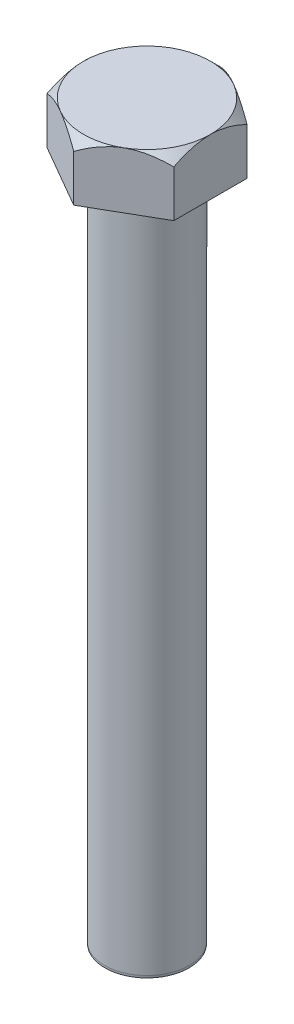
ISO-10303-21;
HEADER;
FILE_DESCRIPTION(('STEP AP214'),'2;1');
FILE_NAME('part.step','',(''),(''),'','','');
FILE_SCHEMA(('AUTOMOTIVE_DESIGN { 1 0 10303 214 1 1 1 1 }'));
ENDSEC;
DATA;
#1=APPLICATION_CONTEXT('core data for automotive mechanical design processes');
#2=APPLICATION_PROTOCOL_DEFINITION('international standard','automotive_design',2000,#1);
#3=PRODUCT_CONTEXT('',#1,'mechanical');
#4=PRODUCT('Part','Part','',(#3));
#5=PRODUCT_RELATED_PRODUCT_CATEGORY('part','',(#4));
#6=PRODUCT_DEFINITION_FORMATION('','',#4);
#7=PRODUCT_DEFINITION_CONTEXT('part definition',#1,'design');
#8=PRODUCT_DEFINITION('design','',#6,#7);
#9=PRODUCT_DEFINITION_SHAPE('','',#8);
#10=(LENGTH_UNIT() NAMED_UNIT(*) SI_UNIT(.MILLI.,.METRE.));
#11=(NAMED_UNIT(*) PLANE_ANGLE_UNIT() SI_UNIT($,.RADIAN.));
#12=(NAMED_UNIT(*) SI_UNIT($,.STERADIAN.) SOLID_ANGLE_UNIT());
#13=UNCERTAINTY_MEASURE_WITH_UNIT(LENGTH_MEASURE(1.E-05),#10,'distance_accuracy_value','');
#14=(GEOMETRIC_REPRESENTATION_CONTEXT(3) GLOBAL_UNCERTAINTY_ASSIGNED_CONTEXT((#13)) GLOBAL_UNIT_ASSIGNED_CONTEXT((#10,
#11,#12)) REPRESENTATION_CONTEXT('',''));
#15=CARTESIAN_POINT('',(0.,0.,0.));
#16=DIRECTION('',(0.,0.,1.));
#17=DIRECTION('',(1.,0.,0.));
#18=AXIS2_PLACEMENT_3D('',#15,#16,#17);
#19=CARTESIAN_POINT('',(7.15009999999996,6.35,-4.12811215973283));
#20=DIRECTION('',(-0.499999999999995,0.,0.866025403784441));
#21=DIRECTION('',(0.866025403784442,0.,0.499999999999995));
#22=AXIS2_PLACEMENT_3D('',#19,#20,#21);
#23=PLANE('',#22);
#24=CARTESIAN_POINT('',(7.15029999999996,5.24376020805829,-4.12799668967899));
#25=CARTESIAN_POINT('',(7.02735981479973,5.31473208114426,-4.19897623869856));
#26=CARTESIAN_POINT('',(6.90347465758507,5.38352591509957,-4.27050136756504));
#27=CARTESIAN_POINT('',(6.65362901516201,5.51609496244518,-4.41474981647385));
#28=CARTESIAN_POINT('',(6.52766744128796,5.57986743492815,-4.48747376505758));
#29=CARTESIAN_POINT('',(6.14521985336649,5.76320280111308,-4.70827998289497));
#30=CARTESIAN_POINT('',(5.88549626774101,5.87400155292641,-4.85823146497073));
#31=CARTESIAN_POINT('',(5.36174291484116,6.06373669034418,-5.16062060425642));
#32=CARTESIAN_POINT('',(5.09784700922402,6.14315107326227,-5.31298097640252));
#33=CARTESIAN_POINT('',(4.69766469893423,6.23501393674774,-5.54402634097325));
#34=CARTESIAN_POINT('',(4.56368142899528,6.26107948825729,-5.62138161793941));
#35=CARTESIAN_POINT('',(4.29458046497126,6.30353452510466,-5.77674713195786));
#36=CARTESIAN_POINT('',(4.15946294347778,6.319925456437,-5.85475726936435));
#37=CARTESIAN_POINT('',(3.83019852397778,6.34740730224126,-6.04485817059725));
#38=CARTESIAN_POINT('',(3.63569685436158,6.35317340265754,-6.15715376190799));
#39=CARTESIAN_POINT('',(3.24704409240871,6.34349459202812,-6.38154253864277));
#40=CARTESIAN_POINT('',(3.05289314684432,6.32804224579773,-6.49363563932778));
#41=CARTESIAN_POINT('',(2.66642169813378,6.27683739902505,-6.71676503427492));
#42=CARTESIAN_POINT('',(2.47410348685935,6.24106219749936,-6.82780000532428));
#43=CARTESIAN_POINT('',(2.09277255135678,6.15115660179108,-7.04796152358701));
#44=CARTESIAN_POINT('',(1.90375957482909,6.09702761510223,-7.15708821646561));
#45=CARTESIAN_POINT('',(1.56823093998172,5.98566881448239,-7.35080576411556));
#46=CARTESIAN_POINT('',(1.42097225552798,5.93136793728872,-7.43582560522543));
#47=CARTESIAN_POINT('',(1.12909829468736,5.81401595028394,-7.6043391150862));
#48=CARTESIAN_POINT('',(0.984483098549458,5.75096457532957,-7.68783273750533));
#49=CARTESIAN_POINT('',(0.6983516080155,5.61752492778284,-7.85303083058874));
#50=CARTESIAN_POINT('',(0.55682717595113,5.54715972840591,-7.93473999953801));
#51=CARTESIAN_POINT('',(0.276398890261677,5.40001620595466,-8.0966453457692));
#52=CARTESIAN_POINT('',(0.137493492810105,5.32324181558632,-8.17684241437976));
#53=CARTESIAN_POINT('',(-0.000199999999999894,5.24376020805829,-8.25633978951933));
#54=B_SPLINE_CURVE_WITH_KNOTS('',3,(#24,#25,#26,#27,#28,#29,#30,#31,#32,#33,#34,#35,#36,#37,#38,
#39,#40,#41,#42,#43,#44,#45,#46,#47,#48,#49,#50,#51,#52,#53),.UNSPECIFIED.,.F.,.F.,(4,2,2,2,2,2,
2,2,2,2,2,2,2,2,4),(0.,0.476107132166216,0.952472371030046,1.91034566100054,2.85300915505907,
3.32341643946382,3.7937533977268,4.46670173744884,5.13988594609707,5.81382359601269,
6.48770957546597,7.02295690652281,7.55822045931063,8.09184389327706,8.6251422671035),.UNSPECIFIED.);
#55=CARTESIAN_POINT('',(7.15009999999996,5.24387568053451,-4.12811215973283));
#56=VERTEX_POINT('',#55);
#57=CARTESIAN_POINT('',(3.57504999999996,6.35,-6.19216823959914));
#58=VERTEX_POINT('',#57);
#59=EDGE_CURVE('E106',#56,#58,#54,.T.);
#60=ORIENTED_EDGE('',*,*,#59,.F.);
#61=DIRECTION('',(0.,-1.,0.));
#62=VECTOR('',#61,1.);
#63=CARTESIAN_POINT('',(7.15009999999996,6.35,-4.12811215973283));
#64=LINE('',#63,#62);
#65=CARTESIAN_POINT('',(7.15009999999996,0.,-4.12811215973283));
#66=VERTEX_POINT('',#65);
#67=EDGE_CURVE('E267',#56,#66,#64,.T.);
#68=ORIENTED_EDGE('',*,*,#67,.T.);
#69=DIRECTION('',(-0.866025403784441,0.,-0.499999999999995));
#70=VECTOR('',#69,1.);
#71=CARTESIAN_POINT('',(7.15009999999996,0.,-4.12811215973283));
#72=LINE('',#71,#70);
#73=CARTESIAN_POINT('',(0.,0.,-8.25622431946549));
#74=VERTEX_POINT('',#73);
#75=EDGE_CURVE('E115',#66,#74,#72,.T.);
#76=ORIENTED_EDGE('',*,*,#75,.T.);
#77=DIRECTION('',(0.,-1.,0.));
#78=VECTOR('',#77,1.);
#79=CARTESIAN_POINT('',(0.,6.35,-8.25622431946549));
#80=LINE('',#79,#78);
#81=CARTESIAN_POINT('',(0.,5.24387568053451,-8.25622431946549));
#82=VERTEX_POINT('',#81);
#83=EDGE_CURVE('E133',#82,#74,#80,.T.);
#84=ORIENTED_EDGE('',*,*,#83,.F.);
#85=EDGE_CURVE('E116',#58,#82,#54,.T.);
#86=ORIENTED_EDGE('',*,*,#85,.F.);
#87=EDGE_LOOP('',(#60,#68,#76,#84,#86));
#88=FACE_BOUND('',#87,.T.);
#89=ADVANCED_FACE('F36',(#88),#23,.F.);
#90=CARTESIAN_POINT('',(0.,6.35,-8.25622431946549));
#91=DIRECTION('',(0.500000000000001,0.,0.866025403784438));
#92=DIRECTION('',(0.866025403784438,0.,-0.500000000000001));
#93=AXIS2_PLACEMENT_3D('',#90,#91,#92);
#94=PLANE('',#93);
#95=CARTESIAN_POINT('',(0.0002,5.24376020805829,-8.25633978951933));
#96=CARTESIAN_POINT('',(-0.122740185200222,5.31473208114426,-8.18536024049976));
#97=CARTESIAN_POINT('',(-0.246625342414885,5.38352591509958,-8.11383511163327));
#98=CARTESIAN_POINT('',(-0.496470984837945,5.51609496244519,-7.96958666272447));
#99=CARTESIAN_POINT('',(-0.622432558711996,5.57986743492816,-7.89686271414073));
#100=CARTESIAN_POINT('',(-1.00488014663348,5.76320280111309,-7.67605649630334));
#101=CARTESIAN_POINT('',(-1.26460373225895,5.87400155292642,-7.52610501422758));
#102=CARTESIAN_POINT('',(-1.78835708515881,6.06373669034419,-7.22371587494188));
#103=CARTESIAN_POINT('',(-2.05225299077595,6.1431510732623,-7.07135550279578));
#104=CARTESIAN_POINT('',(-2.45243530106574,6.23501393674777,-6.84031013822504));
#105=CARTESIAN_POINT('',(-2.58641857100469,6.26107948825732,-6.76295486125888));
#106=CARTESIAN_POINT('',(-2.85551953502872,6.30353452510469,-6.60758934724042));
#107=CARTESIAN_POINT('',(-2.99063705652219,6.31992545643702,-6.52957920983393));
#108=CARTESIAN_POINT('',(-3.3199014760222,6.34740730224129,-6.33947830860103));
#109=CARTESIAN_POINT('',(-3.51440314563839,6.35317340265757,-6.22718271729029));
#110=CARTESIAN_POINT('',(-3.90305590759126,6.34349459202815,-6.00279394055551));
#111=CARTESIAN_POINT('',(-4.09720685315564,6.32804224579776,-5.89070083987049));
#112=CARTESIAN_POINT('',(-4.48367830186619,6.27683739902508,-5.66757144492336));
#113=CARTESIAN_POINT('',(-4.67599651314062,6.24106219749939,-5.556536473874));
#114=CARTESIAN_POINT('',(-5.05732744864318,6.15115660179112,-5.33637495561126));
#115=CARTESIAN_POINT('',(-5.24634042517087,6.09702761510226,-5.22724826273266));
#116=CARTESIAN_POINT('',(-5.58186906001824,5.98566881448243,-5.03353071508271));
#117=CARTESIAN_POINT('',(-5.72912774447198,5.93136793728875,-4.94851087397283));
#118=CARTESIAN_POINT('',(-6.02100170531261,5.81401595028396,-4.77999736411205));
#119=CARTESIAN_POINT('',(-6.16561690145052,5.7509645753296,-4.69650374169292));
#120=CARTESIAN_POINT('',(-6.45174839198449,5.61752492778286,-4.5313056486095));
#121=CARTESIAN_POINT('',(-6.59327282404887,5.54715972840593,-4.44959647966022));
#122=CARTESIAN_POINT('',(-6.87370110973833,5.40001620595466,-4.28769113342903));
#123=CARTESIAN_POINT('',(-7.0126065071899,5.32324181558632,-4.20749406481847));
#124=CARTESIAN_POINT('',(-7.15030000000001,5.24376020805829,-4.12799668967889));
#125=B_SPLINE_CURVE_WITH_KNOTS('',3,(#95,#96,#97,#98,#99,#100,#101,#102,#103,#104,#105,#106,
#107,#108,#109,#110,#111,#112,#113,#114,#115,#116,#117,#118,#119,#120,#121,#122,#123,#124),
.UNSPECIFIED.,.F.,.F.,(4,2,2,2,2,2,2,2,2,2,2,2,2,2,4),(0.,0.476107132166221,0.952472371030056,
1.91034566100056,2.85300915505911,3.32341643946385,3.79375339772684,4.46670173744889,
5.13988594609711,5.81382359601273,6.48770957546601,7.02295690652286,7.55822045931071,
8.09184389327715,8.62514226710361),.UNSPECIFIED.);
#126=CARTESIAN_POINT('',(-3.57505000000001,6.35,-6.19216823959911));
#127=VERTEX_POINT('',#126);
#128=EDGE_CURVE('E123',#82,#127,#125,.T.);
#129=ORIENTED_EDGE('',*,*,#128,.F.);
#130=ORIENTED_EDGE('',*,*,#83,.T.);
#131=DIRECTION('',(-0.866025403784438,0.,0.500000000000001));
#132=VECTOR('',#131,1.);
#133=CARTESIAN_POINT('',(0.,0.,-8.25622431946549));
#134=LINE('',#133,#132);
#135=CARTESIAN_POINT('',(-7.15010000000001,0.,-4.12811215973273));
#136=VERTEX_POINT('',#135);
#137=EDGE_CURVE('E258',#74,#136,#134,.T.);
#138=ORIENTED_EDGE('',*,*,#137,.T.);
#139=DIRECTION('',(0.,-1.,0.));
#140=VECTOR('',#139,1.);
#141=CARTESIAN_POINT('',(-7.15010000000001,6.35,-4.12811215973273));
#142=LINE('',#141,#140);
#143=CARTESIAN_POINT('',(-7.15010000000001,5.24387568053451,-4.12811215973273));
#144=VERTEX_POINT('',#143);
#145=EDGE_CURVE('E200',#144,#136,#142,.T.);
#146=ORIENTED_EDGE('',*,*,#145,.F.);
#147=EDGE_CURVE('E134',#127,#144,#125,.T.);
#148=ORIENTED_EDGE('',*,*,#147,.F.);
#149=EDGE_LOOP('',(#129,#130,#138,#146,#148));
#150=FACE_BOUND('',#149,.T.);
#151=ADVANCED_FACE('F188',(#150),#94,.F.);
#152=CARTESIAN_POINT('',(-7.15010000000001,6.35,-4.12811215973273));
#153=DIRECTION('',(1.,0.,0.));
#154=DIRECTION('',(0.,0.,-1.));
#155=AXIS2_PLACEMENT_3D('',#152,#153,#154);
#156=PLANE('',#155);
#157=CARTESIAN_POINT('',(-7.15010000000003,1.63089085788719,-9.47386909605649));
#158=CARTESIAN_POINT('',(-7.15010000000003,1.81121581560539,-9.24790249070521));
#159=CARTESIAN_POINT('',(-7.15010000000003,1.99016418725543,-9.02082114931031));
#160=CARTESIAN_POINT('',(-7.15010000000003,2.34465316669975,-8.56394073706759));
#161=CARTESIAN_POINT('',(-7.15010000000003,2.5201930563962,-8.33414110959574));
#162=CARTESIAN_POINT('',(-7.15010000000003,2.868446395647,-7.86968034981608));
#163=CARTESIAN_POINT('',(-7.15010000000003,3.0411284373893,-7.63499559658916));
#164=CARTESIAN_POINT('',(-7.15010000000002,3.38131039804522,-7.16191403046406));
#165=CARTESIAN_POINT('',(-7.15010000000002,3.54881066036877,-6.92351746513816));
#166=CARTESIAN_POINT('',(-7.15010000000002,3.89019859321875,-6.42356671095031));
#167=CARTESIAN_POINT('',(-7.15010000000002,4.06356649358224,-6.16165586234294));
#168=CARTESIAN_POINT('',(-7.15010000000002,4.40077381694092,-5.63166319550724));
#169=CARTESIAN_POINT('',(-7.15010000000002,4.56461143837196,-5.36358022380933));
#170=CARTESIAN_POINT('',(-7.15010000000002,4.87937516438839,-4.82096243326766));
#171=CARTESIAN_POINT('',(-7.15010000000002,5.03033869234989,-4.54644949317194));
#172=CARTESIAN_POINT('',(-7.15010000000001,5.31597281014485,-3.98913965325442));
#173=CARTESIAN_POINT('',(-7.15010000000001,5.45065169434768,-3.70634706251455));
#174=CARTESIAN_POINT('',(-7.15010000000001,5.68224395499392,-3.16946720873966));
#175=CARTESIAN_POINT('',(-7.15010000000001,5.78179628197522,-2.91652981738955));
#176=CARTESIAN_POINT('',(-7.15010000000001,5.96068130805078,-2.40346766112692));
#177=CARTESIAN_POINT('',(-7.15010000000001,6.04001286165642,-2.14334248995796));
#178=CARTESIAN_POINT('',(-7.1501,6.17245096820923,-1.62248495464225));
#179=CARTESIAN_POINT('',(-7.1501,6.22609680418521,-1.36189223637387));
#180=CARTESIAN_POINT('',(-7.1501,6.30590762943054,-0.836507861915944));
#181=CARTESIAN_POINT('',(-7.1501,6.33208104018206,-0.571717517759924));
#182=CARTESIAN_POINT('',(-7.1501,6.35408284405149,-0.0577187353176461));
#183=CARTESIAN_POINT('',(-7.1501,6.35173239837544,0.19141159314656));
#184=CARTESIAN_POINT('',(-7.1501,6.32124800606946,0.688077635906895));
#185=CARTESIAN_POINT('',(-7.1501,6.29311214694111,0.935613230550542));
#186=CARTESIAN_POINT('',(-7.15009999999999,6.21229082442829,1.43154670462864));
#187=CARTESIAN_POINT('',(-7.15009999999999,6.15913527095504,1.6798664946589));
#188=CARTESIAN_POINT('',(-7.15009999999999,6.03147971556139,2.17085918647798));
#189=CARTESIAN_POINT('',(-7.15009999999999,5.9569795257941,2.4135320385497));
#190=CARTESIAN_POINT('',(-7.15009999999999,5.79048248965085,2.89215321636684));
#191=CARTESIAN_POINT('',(-7.15009999999999,5.69852189244993,3.12811432942166));
#192=CARTESIAN_POINT('',(-7.15009999999999,5.50032506783947,3.59401612680425));
#193=CARTESIAN_POINT('',(-7.15009999999999,5.39408271156479,3.8239541754974));
#194=CARTESIAN_POINT('',(-7.15009999999998,5.16984050461004,4.27885242834733));
#195=CARTESIAN_POINT('',(-7.15009999999998,5.05180562125056,4.50379521875785));
#196=CARTESIAN_POINT('',(-7.15009999999998,4.80656023664318,4.94854616944678));
#197=CARTESIAN_POINT('',(-7.15009999999998,4.67935108776111,5.168355080205));
#198=CARTESIAN_POINT('',(-7.15009999999998,4.42401096856745,5.59273981639913));
#199=CARTESIAN_POINT('',(-7.15009999999998,4.29623669089792,5.79753139755686));
#200=CARTESIAN_POINT('',(-7.15009999999998,4.03519862932643,6.20359582585859));
#201=CARTESIAN_POINT('',(-7.15009999999998,3.90193444245225,6.4048684131501));
#202=CARTESIAN_POINT('',(-7.15009999999998,3.63195773249821,6.80275896707806));
#203=CARTESIAN_POINT('',(-7.15009999999998,3.49528075722348,6.9994011408559));
#204=CARTESIAN_POINT('',(-7.15009999999997,3.21822330604325,7.38998078224734));
#205=CARTESIAN_POINT('',(-7.15009999999997,3.0778438588743,7.58391897874123));
#206=CARTESIAN_POINT('',(-7.15009999999997,2.93594735354651,7.77672110388246));
#207=B_SPLINE_CURVE_WITH_KNOTS('',3,(#157,#158,#159,#160,#161,#162,#163,#164,#165,#166,#167,
#168,#169,#170,#171,#172,#173,#174,#175,#176,#177,#178,#179,#180,#181,#182,#183,#184,#185,#186,
#187,#188,#189,#190,#191,#192,#193,#194,#195,#196,#197,#198,#199,#200,#201,#202,#203,#204,#205,
#206),.UNSPECIFIED.,.F.,.F.,(4,2,2,2,2,2,2,2,2,2,2,2,2,2,2,2,2,2,2,2,2,2,2,2,4),(0.,
0.867309176171177,1.73479913643537,2.60884845848508,3.48283973039317,4.42495432930787,
5.36724644671029,6.30669878036595,7.24567058249782,8.06046150623437,8.87529857688988,
9.67218308312768,10.4688232385201,11.214882925787,11.9609979526155,12.7217281313764,
13.4824650052708,14.2416394652586,15.0011407631884,15.7629695239043,16.524686213128,
17.248733545678,17.9728341200296,18.6912157430264,19.4093998229271),.UNSPECIFIED.);
#208=CARTESIAN_POINT('',(-7.1501,6.35,0.));
#209=VERTEX_POINT('',#208);
#210=EDGE_CURVE('E182',#144,#209,#207,.T.);
#211=ORIENTED_EDGE('',*,*,#210,.F.);
#212=ORIENTED_EDGE('',*,*,#145,.T.);
#213=DIRECTION('',(0.,0.,1.));
#214=VECTOR('',#213,1.);
#215=CARTESIAN_POINT('',(-7.15010000000001,0.,-4.12811215973273));
#216=LINE('',#215,#214);
#217=CARTESIAN_POINT('',(-7.15009999999999,0.,4.12811215973278));
#218=VERTEX_POINT('',#217);
#219=EDGE_CURVE('E217',#136,#218,#216,.T.);
#220=ORIENTED_EDGE('',*,*,#219,.T.);
#221=DIRECTION('',(0.,-1.,0.));
#222=VECTOR('',#221,1.);
#223=CARTESIAN_POINT('',(-7.15009999999999,6.35,4.12811215973278));
#224=LINE('',#223,#222);
#225=CARTESIAN_POINT('',(-7.15009999999999,5.24387568053451,4.12811215973278));
#226=VERTEX_POINT('',#225);
#227=EDGE_CURVE('E215',#226,#218,#224,.T.);
#228=ORIENTED_EDGE('',*,*,#227,.F.);
#229=EDGE_CURVE('E177',#209,#226,#207,.T.);
#230=ORIENTED_EDGE('',*,*,#229,.F.);
#231=EDGE_LOOP('',(#211,#212,#220,#228,#230));
#232=FACE_BOUND('',#231,.T.);
#233=ADVANCED_FACE('F184',(#232),#156,.F.);
#234=CARTESIAN_POINT('',(-7.15009999999999,6.35,4.12811215973278));
#235=DIRECTION('',(0.499999999999995,0.,-0.866025403784441));
#236=DIRECTION('',(-0.866025403784441,0.,-0.499999999999995));
#237=AXIS2_PLACEMENT_3D('',#234,#235,#236);
#238=PLANE('',#237);
#239=CARTESIAN_POINT('',(-7.15029999999998,5.24376020805829,4.12799668967894));
#240=CARTESIAN_POINT('',(-7.02735981479976,5.31473208114426,4.19897623869851));
#241=CARTESIAN_POINT('',(-6.9034746575851,5.38352591509958,4.27050136756499));
#242=CARTESIAN_POINT('',(-6.65362901516204,5.51609496244519,4.4147498164738));
#243=CARTESIAN_POINT('',(-6.52766744128798,5.57986743492816,4.48747376505753));
#244=CARTESIAN_POINT('',(-6.1452198533665,5.76320280111309,4.70827998289492));
#245=CARTESIAN_POINT('',(-5.88549626774103,5.87400155292642,4.85823146497068));
#246=CARTESIAN_POINT('',(-5.36174291484117,6.06373669034419,5.16062060425638));
#247=CARTESIAN_POINT('',(-5.09784700922402,6.1431510732623,5.31298097640248));
#248=CARTESIAN_POINT('',(-4.69766469893423,6.23501393674777,5.54402634097321));
#249=CARTESIAN_POINT('',(-4.56368142899528,6.26107948825732,5.62138161793937));
#250=CARTESIAN_POINT('',(-4.29458046497126,6.30353452510469,5.77674713195783));
#251=CARTESIAN_POINT('',(-4.15946294347778,6.31992545643702,5.85475726936432));
#252=CARTESIAN_POINT('',(-3.83019852397777,6.34740730224129,6.04485817059721));
#253=CARTESIAN_POINT('',(-3.63569685436158,6.35317340265757,6.15715376190795));
#254=CARTESIAN_POINT('',(-3.24704409240871,6.34349459202815,6.38154253864273));
#255=CARTESIAN_POINT('',(-3.05289314684433,6.32804224579776,6.49363563932775));
#256=CARTESIAN_POINT('',(-2.66642169813378,6.27683739902508,6.71676503427488));
#257=CARTESIAN_POINT('',(-2.47410348685935,6.24106219749939,6.82780000532424));
#258=CARTESIAN_POINT('',(-2.09277255135678,6.15115660179112,7.04796152358698));
#259=CARTESIAN_POINT('',(-1.90375957482909,6.09702761510226,7.15708821646557));
#260=CARTESIAN_POINT('',(-1.56823093998172,5.98566881448243,7.35080576411552));
#261=CARTESIAN_POINT('',(-1.42097225552798,5.93136793728875,7.4358256052254));
#262=CARTESIAN_POINT('',(-1.12909829468735,5.81401595028396,7.60433911508618));
#263=CARTESIAN_POINT('',(-0.984483098549436,5.7509645753296,7.68783273750531));
#264=CARTESIAN_POINT('',(-0.698351608015466,5.61752492778286,7.85303083058873));
#265=CARTESIAN_POINT('',(-0.556827175951092,5.54715972840593,7.934739999538));
#266=CARTESIAN_POINT('',(-0.276398890261629,5.40001620595466,8.0966453457692));
#267=CARTESIAN_POINT('',(-0.137493492810052,5.32324181558632,8.17684241437975));
#268=CARTESIAN_POINT('',(0.000200000000057124,5.24376020805829,8.25633978951933));
#269=B_SPLINE_CURVE_WITH_KNOTS('',3,(#239,#240,#241,#242,#243,#244,#245,#246,#247,#248,#249,
#250,#251,#252,#253,#254,#255,#256,#257,#258,#259,#260,#261,#262,#263,#264,#265,#266,#267,#268),
.UNSPECIFIED.,.F.,.F.,(4,2,2,2,2,2,2,2,2,2,2,2,2,2,4),(0.,0.476107132166221,0.952472371030058,
1.91034566100057,2.85300915505911,3.32341643946385,3.79375339772684,4.46670173744888,
5.13988594609711,5.81382359601273,6.48770957546601,7.02295690652286,7.55822045931071,
8.09184389327715,8.62514226710361),.UNSPECIFIED.);
#270=CARTESIAN_POINT('',(-3.57504999999996,6.35,6.19216823959913));
#271=VERTEX_POINT('',#270);
#272=EDGE_CURVE('E183',#226,#271,#269,.T.);
#273=ORIENTED_EDGE('',*,*,#272,.F.);
#274=ORIENTED_EDGE('',*,*,#227,.T.);
#275=DIRECTION('',(0.866025403784441,0.,0.499999999999995));
#276=VECTOR('',#275,1.);
#277=CARTESIAN_POINT('',(-7.15009999999999,0.,4.12811215973278));
#278=LINE('',#277,#276);
#279=CARTESIAN_POINT('',(0.,0.,8.25622431946549));
#280=VERTEX_POINT('',#279);
#281=EDGE_CURVE('E259',#218,#280,#278,.T.);
#282=ORIENTED_EDGE('',*,*,#281,.T.);
#283=DIRECTION('',(0.,-1.,0.));
#284=VECTOR('',#283,1.);
#285=CARTESIAN_POINT('',(0.,6.35,8.25622431946549));
#286=LINE('',#285,#284);
#287=CARTESIAN_POINT('',(0.,5.24387568053451,8.25622431946549));
#288=VERTEX_POINT('',#287);
#289=EDGE_CURVE('E221',#288,#280,#286,.T.);
#290=ORIENTED_EDGE('',*,*,#289,.F.);
#291=EDGE_CURVE('E172',#271,#288,#269,.T.);
#292=ORIENTED_EDGE('',*,*,#291,.F.);
#293=EDGE_LOOP('',(#273,#274,#282,#290,#292));
#294=FACE_BOUND('',#293,.T.);
#295=ADVANCED_FACE('F187',(#294),#238,.F.);
#296=CARTESIAN_POINT('',(0.,6.35,8.25622431946549));
#297=DIRECTION('',(-0.500000000000007,0.,-0.866025403784435));
#298=DIRECTION('',(-0.866025403784435,0.,0.500000000000007));
#299=AXIS2_PLACEMENT_3D('',#296,#297,#298);
#300=PLANE('',#299);
#301=CARTESIAN_POINT('',(-0.000199999999942347,5.24376020805829,8.25633978951933));
#302=CARTESIAN_POINT('',(0.122740185200279,5.31473208114426,8.18536024049976));
#303=CARTESIAN_POINT('',(0.246625342414941,5.38352591509958,8.11383511163327));
#304=CARTESIAN_POINT('',(0.496470984838001,5.51609496244519,7.96958666272446));
#305=CARTESIAN_POINT('',(0.622432558712051,5.57986743492816,7.89686271414073));
#306=CARTESIAN_POINT('',(1.00488014663353,5.76320280111309,7.67605649630334));
#307=CARTESIAN_POINT('',(1.264603732259,5.87400155292642,7.52610501422757));
#308=CARTESIAN_POINT('',(1.78835708515886,6.06373669034419,7.22371587494186));
#309=CARTESIAN_POINT('',(2.052252990776,6.1431510732623,7.07135550279576));
#310=CARTESIAN_POINT('',(2.45243530106579,6.23501393674777,6.84031013822502));
#311=CARTESIAN_POINT('',(2.58641857100474,6.26107948825731,6.76295486125886));
#312=CARTESIAN_POINT('',(2.85551953502876,6.30353452510469,6.6075893472404));
#313=CARTESIAN_POINT('',(2.99063705652223,6.31992545643702,6.52957920983391));
#314=CARTESIAN_POINT('',(3.31990147602224,6.34740730224129,6.33947830860101));
#315=CARTESIAN_POINT('',(3.51440314563843,6.35317340265757,6.22718271729027));
#316=CARTESIAN_POINT('',(3.9030559075913,6.34349459202815,6.00279394055549));
#317=CARTESIAN_POINT('',(4.09720685315568,6.32804224579776,5.89070083987047));
#318=CARTESIAN_POINT('',(4.48367830186623,6.27683739902508,5.66757144492333));
#319=CARTESIAN_POINT('',(4.67599651314065,6.24106219749939,5.55653647387397));
#320=CARTESIAN_POINT('',(5.05732744864322,6.15115660179112,5.33637495561122));
#321=CARTESIAN_POINT('',(5.24634042517091,6.09702761510226,5.22724826273263));
#322=CARTESIAN_POINT('',(5.58186906001828,5.98566881448243,5.03353071508267));
#323=CARTESIAN_POINT('',(5.72912774447202,5.93136793728875,4.94851087397279));
#324=CARTESIAN_POINT('',(6.02100170531265,5.81401595028396,4.77999736411201));
#325=CARTESIAN_POINT('',(6.16561690145056,5.7509645753296,4.69650374169287));
#326=CARTESIAN_POINT('',(6.45174839198452,5.61752492778285,4.53130564860946));
#327=CARTESIAN_POINT('',(6.5932728240489,5.54715972840592,4.44959647966018));
#328=CARTESIAN_POINT('',(6.87370110973836,5.40001620595466,4.28769113342898));
#329=CARTESIAN_POINT('',(7.01260650718993,5.32324181558632,4.20749406481842));
#330=CARTESIAN_POINT('',(7.15030000000004,5.24376020805829,4.12799668967884));
#331=B_SPLINE_CURVE_WITH_KNOTS('',3,(#301,#302,#303,#304,#305,#306,#307,#308,#309,#310,#311,
#312,#313,#314,#315,#316,#317,#318,#319,#320,#321,#322,#323,#324,#325,#326,#327,#328,#329,#330),
.UNSPECIFIED.,.F.,.F.,(4,2,2,2,2,2,2,2,2,2,2,2,2,2,4),(0.,0.476107132166222,0.952472371030056,
1.91034566100056,2.8530091550591,3.32341643946385,3.79375339772684,4.46670173744888,
5.13988594609711,5.81382359601273,6.48770957546601,7.02295690652286,7.55822045931071,
8.09184389327715,8.62514226710361),.UNSPECIFIED.);
#332=CARTESIAN_POINT('',(3.57505000000005,6.35,6.19216823959909));
#333=VERTEX_POINT('',#332);
#334=EDGE_CURVE('E278',#288,#333,#331,.T.);
#335=ORIENTED_EDGE('',*,*,#334,.F.);
#336=ORIENTED_EDGE('',*,*,#289,.T.);
#337=DIRECTION('',(0.866025403784435,0.,-0.500000000000007));
#338=VECTOR('',#337,1.);
#339=CARTESIAN_POINT('',(0.,0.,8.25622431946549));
#340=LINE('',#339,#338);
#341=CARTESIAN_POINT('',(7.15010000000004,0.,4.12811215973268));
#342=VERTEX_POINT('',#341);
#343=EDGE_CURVE('E263',#280,#342,#340,.T.);
#344=ORIENTED_EDGE('',*,*,#343,.T.);
#345=DIRECTION('',(0.,-1.,0.));
#346=VECTOR('',#345,1.);
#347=CARTESIAN_POINT('',(7.15010000000004,6.35,4.12811215973268));
#348=LINE('',#347,#346);
#349=CARTESIAN_POINT('',(7.15010000000004,5.24387568053451,4.12811215973268));
#350=VERTEX_POINT('',#349);
#351=EDGE_CURVE('E224',#350,#342,#348,.T.);
#352=ORIENTED_EDGE('',*,*,#351,.F.);
#353=EDGE_CURVE('E165',#333,#350,#331,.T.);
#354=ORIENTED_EDGE('',*,*,#353,.F.);
#355=EDGE_LOOP('',(#335,#336,#344,#352,#354));
#356=FACE_BOUND('',#355,.T.);
#357=ADVANCED_FACE('F275',(#356),#300,.F.);
#358=CARTESIAN_POINT('',(7.15010000000004,6.35,4.12811215973268));
#359=DIRECTION('',(-1.,0.,0.));
#360=DIRECTION('',(0.,0.,1.));
#361=AXIS2_PLACEMENT_3D('',#358,#359,#360);
#362=PLANE('',#361);
#363=CARTESIAN_POINT('',(7.1500999999999,1.63089084568141,-9.47386911134843));
#364=CARTESIAN_POINT('',(7.1500999999999,1.8112158038748,-9.24790250553399));
#365=CARTESIAN_POINT('',(7.15009999999991,1.9901641759994,-9.02082116367475));
#366=CARTESIAN_POINT('',(7.15009999999991,2.34465315639033,-8.56394075049952));
#367=CARTESIAN_POINT('',(7.15009999999991,2.52019304655884,-8.33414112255949));
#368=CARTESIAN_POINT('',(7.15009999999992,2.86844638675769,-7.86968036182892));
#369=CARTESIAN_POINT('',(7.15009999999992,3.04112842897584,-7.63499560811917));
#370=CARTESIAN_POINT('',(7.15009999999992,3.38131039057672,-7.16191404102097));
#371=CARTESIAN_POINT('',(7.15009999999993,3.54881065336935,-6.92351747520483));
#372=CARTESIAN_POINT('',(7.15009999999993,3.89019858720553,-6.42356671995492));
#373=CARTESIAN_POINT('',(7.15009999999994,4.06356648808435,-6.16165587077427));
#374=CARTESIAN_POINT('',(7.15009999999994,4.40077381245204,-5.63166320277258));
#375=CARTESIAN_POINT('',(7.15009999999994,4.56461143437675,-5.36358023048195));
#376=CARTESIAN_POINT('',(7.15009999999995,4.87937516134173,-4.82096243873408));
#377=CARTESIAN_POINT('',(7.15009999999995,5.03033868975839,-4.54644949802505));
#378=CARTESIAN_POINT('',(7.15009999999996,5.31597280840798,-3.98913965684663));
#379=CARTESIAN_POINT('',(7.15009999999996,5.45065169301035,-3.7063470654592));
#380=CARTESIAN_POINT('',(7.15009999999997,5.68224395389446,-3.16946721142345));
#381=CARTESIAN_POINT('',(7.15009999999997,5.7817962807887,-2.91652982049303));
#382=CARTESIAN_POINT('',(7.15009999999997,5.96068130677324,-2.40346766509055));
#383=CARTESIAN_POINT('',(7.15009999999998,6.04001286037489,-2.14334249436203));
#384=CARTESIAN_POINT('',(7.15009999999998,6.17245096702639,-1.62248495991549));
#385=CARTESIAN_POINT('',(7.15009999999999,6.22609680310152,-1.36189224207524));
#386=CARTESIAN_POINT('',(7.15009999999999,6.30590762865255,-0.836507868466953));
#387=CARTESIAN_POINT('',(7.15009999999999,6.33208103961055,-0.571717524732427));
#388=CARTESIAN_POINT('',(7.1501,6.35408284398224,-0.057718742911977));
#389=CARTESIAN_POINT('',(7.1501,6.35173239857837,0.191411585350977));
#390=CARTESIAN_POINT('',(7.15010000000001,6.32124800684642,0.688077627739453));
#391=CARTESIAN_POINT('',(7.15010000000001,6.29311214801996,0.935613222212498));
#392=CARTESIAN_POINT('',(7.15010000000001,6.2122908261277,1.43154669595436));
#393=CARTESIAN_POINT('',(7.15010000000002,6.15913527297532,1.67986648581989));
#394=CARTESIAN_POINT('',(7.15010000000002,6.03147971821725,2.17085917733268));
#395=CARTESIAN_POINT('',(7.15010000000002,5.95697952876465,2.41353202926283));
#396=CARTESIAN_POINT('',(7.15010000000003,5.79048249349503,2.89215320606262));
#397=CARTESIAN_POINT('',(7.15010000000003,5.69852189690814,3.12811431826103));
#398=CARTESIAN_POINT('',(7.15010000000004,5.50032507358712,3.59401611397431));
#399=CARTESIAN_POINT('',(7.15010000000004,5.39408271798793,3.82395416185457));
#400=CARTESIAN_POINT('',(7.15010000000004,5.16984051242519,4.27885241310805));
#401=CARTESIAN_POINT('',(7.15010000000005,5.05180562978249,4.50379520273518));
#402=CARTESIAN_POINT('',(7.15010000000005,4.80656024663132,4.94854615188308));
#403=CARTESIAN_POINT('',(7.15010000000005,4.67935109848869,5.16835506188367));
#404=CARTESIAN_POINT('',(7.15010000000006,4.42401098069604,5.59273979670796));
#405=CARTESIAN_POINT('',(7.15010000000006,4.29623670368454,5.79753137725083));
#406=CARTESIAN_POINT('',(7.15010000000007,4.03519864343176,6.20359580433172));
#407=CARTESIAN_POINT('',(7.15010000000007,3.90193445721827,6.40486839101724));
#408=CARTESIAN_POINT('',(7.15010000000007,3.63195774857802,6.80275894374802));
#409=CARTESIAN_POINT('',(7.15010000000007,3.49528077395631,6.99940111693457));
#410=CARTESIAN_POINT('',(7.15010000000008,3.21822332408119,7.38998075714733));
#411=CARTESIAN_POINT('',(7.15010000000008,3.07784387756432,7.58391895305384));
#412=CARTESIAN_POINT('',(7.15010000000008,2.93594737288767,7.7767210776087));
#413=B_SPLINE_CURVE_WITH_KNOTS('',3,(#363,#364,#365,#366,#367,#368,#369,#370,#371,#372,#373,
#374,#375,#376,#377,#378,#379,#380,#381,#382,#383,#384,#385,#386,#387,#388,#389,#390,#391,#392,
#393,#394,#395,#396,#397,#398,#399,#400,#401,#402,#403,#404,#405,#406,#407,#408,#409,#410,#411,
#412),.UNSPECIFIED.,.F.,.F.,(4,2,2,2,2,2,2,2,2,2,2,2,2,2,2,2,2,2,2,2,2,2,2,2,4),(0.,
0.867309178146457,1.7347991403865,2.60884846444894,3.4828397383694,4.42495433957124,
5.36724645926233,6.30669879518682,7.24567059958342,8.06046152205712,8.87529859145194,
9.67218309649984,10.468823250704,11.2148829373626,11.9609979635813,12.7217281416573,
13.4824650148672,14.2416394717964,15.001140766664,15.7629695243005,16.524686210446,
17.248733540386,17.9728341121274,18.6912157325493,19.4093998098754),.UNSPECIFIED.);
#414=CARTESIAN_POINT('',(7.1501,6.35,0.));
#415=VERTEX_POINT('',#414);
#416=EDGE_CURVE('E271',#350,#415,#413,.F.);
#417=ORIENTED_EDGE('',*,*,#416,.F.);
#418=ORIENTED_EDGE('',*,*,#351,.T.);
#419=DIRECTION('',(0.,0.,-1.));
#420=VECTOR('',#419,1.);
#421=CARTESIAN_POINT('',(7.15010000000004,0.,4.12811215973268));
#422=LINE('',#421,#420);
#423=EDGE_CURVE('E257',#342,#66,#422,.T.);
#424=ORIENTED_EDGE('',*,*,#423,.T.);
#425=ORIENTED_EDGE('',*,*,#67,.F.);
#426=EDGE_CURVE('E111',#415,#56,#413,.F.);
#427=ORIENTED_EDGE('',*,*,#426,.F.);
#428=EDGE_LOOP('',(#417,#418,#424,#425,#427));
#429=FACE_BOUND('',#428,.T.);
#430=ADVANCED_FACE('F251',(#429),#362,.F.);
#431=CARTESIAN_POINT('',(0.,0.,0.));
#432=DIRECTION('',(0.,1.,0.));
#433=DIRECTION('',(0.,0.,1.));
#434=AXIS2_PLACEMENT_3D('',#431,#432,#433);
#435=PLANE('',#434);
#436=CARTESIAN_POINT('',(0.,0.,0.));
#437=DIRECTION('',(0.,1.,0.));
#438=DIRECTION('',(0.,0.,1.));
#439=AXIS2_PLACEMENT_3D('',#436,#437,#438);
#440=CIRCLE('',#439,4.7625);
#441=CARTESIAN_POINT('',(0.,0.,4.7625));
#442=VERTEX_POINT('',#441);
#443=EDGE_CURVE('E229',#442,#442,#440,.F.);
#444=ORIENTED_EDGE('',*,*,#443,.F.);
#445=EDGE_LOOP('',(#444));
#446=FACE_BOUND('',#445,.T.);
#447=ORIENTED_EDGE('',*,*,#75,.F.);
#448=ORIENTED_EDGE('',*,*,#423,.F.);
#449=ORIENTED_EDGE('',*,*,#343,.F.);
#450=ORIENTED_EDGE('',*,*,#281,.F.);
#451=ORIENTED_EDGE('',*,*,#219,.F.);
#452=ORIENTED_EDGE('',*,*,#137,.F.);
#453=EDGE_LOOP('',(#447,#448,#449,#450,#451,#452));
#454=FACE_BOUND('',#453,.T.);
#455=ADVANCED_FACE('F246',(#446,#454),#435,.F.);
#456=CARTESIAN_POINT('',(0.,-76.2,0.));
#457=DIRECTION('',(0.,1.,0.));
#458=DIRECTION('',(0.,0.,1.));
#459=AXIS2_PLACEMENT_3D('',#456,#457,#458);
#460=CYLINDRICAL_SURFACE('',#459,4.7625);
#461=CARTESIAN_POINT('',(0.,-75.946000000004,0.));
#462=DIRECTION('',(0.,-1.,0.));
#463=DIRECTION('',(0.,0.,-1.));
#464=AXIS2_PLACEMENT_3D('',#461,#462,#463);
#465=CIRCLE('',#464,4.7625);
#466=CARTESIAN_POINT('',(0.,-75.946000000004,-4.7625));
#467=VERTEX_POINT('',#466);
#468=EDGE_CURVE('E12',#467,#467,#465,.F.);
#469=ORIENTED_EDGE('',*,*,#468,.T.);
#470=EDGE_LOOP('',(#469));
#471=FACE_BOUND('',#470,.T.);
#472=ORIENTED_EDGE('',*,*,#443,.T.);
#473=EDGE_LOOP('',(#472));
#474=FACE_BOUND('',#473,.T.);
#475=ADVANCED_FACE('F243',(#471,#474),#460,.T.);
#476=CARTESIAN_POINT('',(0.,-76.2,0.));
#477=DIRECTION('',(0.,-1.,0.));
#478=DIRECTION('',(0.,0.,-1.));
#479=AXIS2_PLACEMENT_3D('',#476,#477,#478);
#480=PLANE('',#479);
#481=CARTESIAN_POINT('',(0.,-76.2,0.));
#482=DIRECTION('',(0.,-1.,0.));
#483=DIRECTION('',(0.,0.,-1.));
#484=AXIS2_PLACEMENT_3D('',#481,#482,#483);
#485=CIRCLE('',#484,4.74027787946477);
#486=CARTESIAN_POINT('',(0.,-76.2,-4.74027787946477));
#487=VERTEX_POINT('',#486);
#488=EDGE_CURVE('E44',#487,#487,#485,.T.);
#489=ORIENTED_EDGE('',*,*,#488,.T.);
#490=EDGE_LOOP('',(#489));
#491=FACE_BOUND('',#490,.T.);
#492=ADVANCED_FACE('F152',(#491),#480,.T.);
#493=CARTESIAN_POINT('',(0.,6.35,0.));
#494=DIRECTION('',(0.,-1.,0.));
#495=DIRECTION('',(0.,0.,1.));
#496=AXIS2_PLACEMENT_3D('',#493,#494,#495);
#497=CONICAL_SURFACE('',#496,7.1501,0.78539816339745);
#498=ORIENTED_EDGE('',*,*,#291,.T.);
#499=ORIENTED_EDGE('',*,*,#334,.T.);
#500=CARTESIAN_POINT('',(0.,6.35,0.));
#501=DIRECTION('',(0.,1.,0.));
#502=DIRECTION('',(0.,0.,1.));
#503=AXIS2_PLACEMENT_3D('',#500,#501,#502);
#504=CIRCLE('',#503,7.1501);
#505=EDGE_CURVE('E130',#271,#333,#504,.T.);
#506=ORIENTED_EDGE('',*,*,#505,.F.);
#507=EDGE_LOOP('',(#498,#499,#506));
#508=FACE_BOUND('',#507,.T.);
#509=ADVANCED_FACE('F280',(#508),#497,.T.);
#510=ORIENTED_EDGE('',*,*,#229,.T.);
#511=ORIENTED_EDGE('',*,*,#272,.T.);
#512=EDGE_CURVE('E208',#209,#271,#504,.T.);
#513=ORIENTED_EDGE('',*,*,#512,.F.);
#514=EDGE_LOOP('',(#510,#511,#513));
#515=FACE_BOUND('',#514,.T.);
#516=ADVANCED_FACE('F209',(#515),#497,.T.);
#517=ORIENTED_EDGE('',*,*,#147,.T.);
#518=ORIENTED_EDGE('',*,*,#210,.T.);
#519=EDGE_CURVE('E127',#127,#209,#504,.T.);
#520=ORIENTED_EDGE('',*,*,#519,.F.);
#521=EDGE_LOOP('',(#517,#518,#520));
#522=FACE_BOUND('',#521,.T.);
#523=ADVANCED_FACE('F204',(#522),#497,.T.);
#524=ORIENTED_EDGE('',*,*,#85,.T.);
#525=ORIENTED_EDGE('',*,*,#128,.T.);
#526=EDGE_CURVE('E120',#58,#127,#504,.T.);
#527=ORIENTED_EDGE('',*,*,#526,.F.);
#528=EDGE_LOOP('',(#524,#525,#527));
#529=FACE_BOUND('',#528,.T.);
#530=ADVANCED_FACE('F121',(#529),#497,.T.);
#531=ORIENTED_EDGE('',*,*,#59,.T.);
#532=EDGE_CURVE('E109',#415,#58,#504,.T.);
#533=ORIENTED_EDGE('',*,*,#532,.F.);
#534=ORIENTED_EDGE('',*,*,#426,.T.);
#535=EDGE_LOOP('',(#531,#533,#534));
#536=FACE_BOUND('',#535,.T.);
#537=ADVANCED_FACE('F108',(#536),#497,.T.);
#538=ORIENTED_EDGE('',*,*,#353,.T.);
#539=ORIENTED_EDGE('',*,*,#416,.T.);
#540=CARTESIAN_POINT('',(0.,6.35,0.));
#541=DIRECTION('',(0.,1.,0.));
#542=DIRECTION('',(0.,0.,1.));
#543=AXIS2_PLACEMENT_3D('',#540,#541,#542);
#544=CIRCLE('',#543,7.1501);
#545=EDGE_CURVE('E51',#333,#415,#544,.T.);
#546=ORIENTED_EDGE('',*,*,#545,.F.);
#547=EDGE_LOOP('',(#538,#539,#546));
#548=FACE_BOUND('',#547,.T.);
#549=ADVANCED_FACE('F151',(#548),#497,.T.);
#550=CARTESIAN_POINT('',(0.,6.35,0.));
#551=DIRECTION('',(0.,1.,0.));
#552=DIRECTION('',(0.,0.,1.));
#553=AXIS2_PLACEMENT_3D('',#550,#551,#552);
#554=PLANE('',#553);
#555=ORIENTED_EDGE('',*,*,#505,.T.);
#556=ORIENTED_EDGE('',*,*,#545,.T.);
#557=ORIENTED_EDGE('',*,*,#532,.T.);
#558=ORIENTED_EDGE('',*,*,#526,.T.);
#559=ORIENTED_EDGE('',*,*,#519,.T.);
#560=ORIENTED_EDGE('',*,*,#512,.T.);
#561=EDGE_LOOP('',(#555,#556,#557,#558,#559,#560));
#562=FACE_BOUND('',#561,.T.);
#563=ADVANCED_FACE('F129',(#562),#554,.T.);
#564=CARTESIAN_POINT('',(0.,-76.2,0.));
#565=DIRECTION('',(0.,1.,0.));
#566=DIRECTION('',(0.,0.,1.));
#567=AXIS2_PLACEMENT_3D('',#564,#565,#566);
#568=CONICAL_SURFACE('',#567,4.74027787946477,0.0872664625997067);
#569=ORIENTED_EDGE('',*,*,#468,.F.);
#570=EDGE_LOOP('',(#569));
#571=FACE_BOUND('',#570,.T.);
#572=ORIENTED_EDGE('',*,*,#488,.F.);
#573=EDGE_LOOP('',(#572));
#574=FACE_BOUND('',#573,.T.);
#575=ADVANCED_FACE('F38',(#571,#574),#568,.T.);
#576=CLOSED_SHELL('',(#89,#151,#233,#295,#357,#430,#455,#475,#492,#509,#516,#523,#530,#537,#549,
#563,#575));
#577=MANIFOLD_SOLID_BREP('B2',#576);
#578=ADVANCED_BREP_SHAPE_REPRESENTATION('',(#18,#577),#14);
#579=SHAPE_DEFINITION_REPRESENTATION(#9,#578);
ENDSEC;
END-ISO-10303-21;
